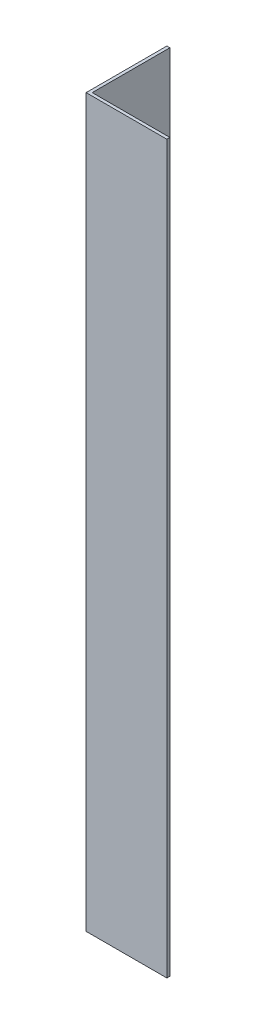
ISO-10303-21;
HEADER;
FILE_DESCRIPTION(('STEP AP214'),'2;1');
FILE_NAME('part.step','',(''),(''),'','','');
FILE_SCHEMA(('AUTOMOTIVE_DESIGN { 1 0 10303 214 1 1 1 1 }'));
ENDSEC;
DATA;
#1=APPLICATION_CONTEXT('core data for automotive mechanical design processes');
#2=APPLICATION_PROTOCOL_DEFINITION('international standard','automotive_design',2000,#1);
#3=PRODUCT_CONTEXT('',#1,'mechanical');
#4=PRODUCT('Part','Part','',(#3));
#5=PRODUCT_RELATED_PRODUCT_CATEGORY('part','',(#4));
#6=PRODUCT_DEFINITION_FORMATION('','',#4);
#7=PRODUCT_DEFINITION_CONTEXT('part definition',#1,'design');
#8=PRODUCT_DEFINITION('design','',#6,#7);
#9=PRODUCT_DEFINITION_SHAPE('','',#8);
#10=(LENGTH_UNIT() NAMED_UNIT(*) SI_UNIT(.MILLI.,.METRE.));
#11=(NAMED_UNIT(*) PLANE_ANGLE_UNIT() SI_UNIT($,.RADIAN.));
#12=(NAMED_UNIT(*) SI_UNIT($,.STERADIAN.) SOLID_ANGLE_UNIT());
#13=UNCERTAINTY_MEASURE_WITH_UNIT(LENGTH_MEASURE(1.E-05),#10,'distance_accuracy_value','');
#14=(GEOMETRIC_REPRESENTATION_CONTEXT(3) GLOBAL_UNCERTAINTY_ASSIGNED_CONTEXT((#13)) GLOBAL_UNIT_ASSIGNED_CONTEXT((#10,
#11,#12)) REPRESENTATION_CONTEXT('',''));
#15=CARTESIAN_POINT('',(0.,0.,0.));
#16=DIRECTION('',(0.,0.,1.));
#17=DIRECTION('',(1.,0.,0.));
#18=AXIS2_PLACEMENT_3D('',#15,#16,#17);
#19=CARTESIAN_POINT('',(20.,180.,0.));
#20=DIRECTION('',(0.,0.,-1.));
#21=DIRECTION('',(-1.,0.,0.));
#22=AXIS2_PLACEMENT_3D('',#19,#20,#21);
#23=PLANE('',#22);
#24=DIRECTION('',(1.,0.,0.));
#25=VECTOR('',#24,1.);
#26=CARTESIAN_POINT('',(20.,0.,0.));
#27=LINE('',#26,#25);
#28=CARTESIAN_POINT('',(0.,0.,0.));
#29=VERTEX_POINT('',#28);
#30=CARTESIAN_POINT('',(20.,0.,0.));
#31=VERTEX_POINT('',#30);
#32=EDGE_CURVE('E120',#29,#31,#27,.T.);
#33=ORIENTED_EDGE('',*,*,#32,.T.);
#34=DIRECTION('',(0.,-1.,0.));
#35=VECTOR('',#34,1.);
#36=CARTESIAN_POINT('',(20.,180.,0.));
#37=LINE('',#36,#35);
#38=CARTESIAN_POINT('',(20.,180.,0.));
#39=VERTEX_POINT('',#38);
#40=EDGE_CURVE('E11',#39,#31,#37,.T.);
#41=ORIENTED_EDGE('',*,*,#40,.F.);
#42=DIRECTION('',(1.,0.,0.));
#43=VECTOR('',#42,1.);
#44=CARTESIAN_POINT('',(20.,180.,0.));
#45=LINE('',#44,#43);
#46=CARTESIAN_POINT('',(0.,180.,0.));
#47=VERTEX_POINT('',#46);
#48=EDGE_CURVE('E130',#47,#39,#45,.T.);
#49=ORIENTED_EDGE('',*,*,#48,.F.);
#50=DIRECTION('',(0.,-1.,0.));
#51=VECTOR('',#50,1.);
#52=CARTESIAN_POINT('',(0.,180.,0.));
#53=LINE('',#52,#51);
#54=EDGE_CURVE('E116',#47,#29,#53,.T.);
#55=ORIENTED_EDGE('',*,*,#54,.T.);
#56=EDGE_LOOP('',(#33,#41,#49,#55));
#57=FACE_BOUND('',#56,.T.);
#58=ADVANCED_FACE('F36',(#57),#23,.F.);
#59=CARTESIAN_POINT('',(20.,180.,-0.75));
#60=DIRECTION('',(-1.,0.,0.));
#61=DIRECTION('',(0.,0.,1.));
#62=AXIS2_PLACEMENT_3D('',#59,#60,#61);
#63=PLANE('',#62);
#64=DIRECTION('',(0.,0.,-1.));
#65=VECTOR('',#64,1.);
#66=CARTESIAN_POINT('',(20.,0.,-0.75));
#67=LINE('',#66,#65);
#68=CARTESIAN_POINT('',(20.,0.,-0.75));
#69=VERTEX_POINT('',#68);
#70=EDGE_CURVE('E123',#31,#69,#67,.T.);
#71=ORIENTED_EDGE('',*,*,#70,.T.);
#72=DIRECTION('',(0.,-1.,0.));
#73=VECTOR('',#72,1.);
#74=CARTESIAN_POINT('',(20.,180.,-0.75));
#75=LINE('',#74,#73);
#76=CARTESIAN_POINT('',(20.,180.,-0.75));
#77=VERTEX_POINT('',#76);
#78=EDGE_CURVE('E44',#77,#69,#75,.T.);
#79=ORIENTED_EDGE('',*,*,#78,.F.);
#80=DIRECTION('',(0.,0.,-1.));
#81=VECTOR('',#80,1.);
#82=CARTESIAN_POINT('',(20.,180.,-0.75));
#83=LINE('',#82,#81);
#84=EDGE_CURVE('E89',#39,#77,#83,.T.);
#85=ORIENTED_EDGE('',*,*,#84,.F.);
#86=ORIENTED_EDGE('',*,*,#40,.T.);
#87=EDGE_LOOP('',(#71,#79,#85,#86));
#88=FACE_BOUND('',#87,.T.);
#89=ADVANCED_FACE('F154',(#88),#63,.F.);
#90=CARTESIAN_POINT('',(0.749999999999998,180.,-0.749999999999998));
#91=DIRECTION('',(0.,0.,1.));
#92=DIRECTION('',(1.,0.,0.));
#93=AXIS2_PLACEMENT_3D('',#90,#91,#92);
#94=PLANE('',#93);
#95=DIRECTION('',(-1.,0.,0.));
#96=VECTOR('',#95,1.);
#97=CARTESIAN_POINT('',(0.749999999999998,0.,-0.749999999999998));
#98=LINE('',#97,#96);
#99=CARTESIAN_POINT('',(0.749999999999998,0.,-0.749999999999998));
#100=VERTEX_POINT('',#99);
#101=EDGE_CURVE('E125',#69,#100,#98,.T.);
#102=ORIENTED_EDGE('',*,*,#101,.T.);
#103=DIRECTION('',(0.,-1.,0.));
#104=VECTOR('',#103,1.);
#105=CARTESIAN_POINT('',(0.749999999999998,180.,-0.749999999999998));
#106=LINE('',#105,#104);
#107=CARTESIAN_POINT('',(0.749999999999998,180.,-0.749999999999998));
#108=VERTEX_POINT('',#107);
#109=EDGE_CURVE('E111',#108,#100,#106,.T.);
#110=ORIENTED_EDGE('',*,*,#109,.F.);
#111=DIRECTION('',(-1.,0.,0.));
#112=VECTOR('',#111,1.);
#113=CARTESIAN_POINT('',(0.749999999999998,180.,-0.749999999999998));
#114=LINE('',#113,#112);
#115=EDGE_CURVE('E102',#77,#108,#114,.T.);
#116=ORIENTED_EDGE('',*,*,#115,.F.);
#117=ORIENTED_EDGE('',*,*,#78,.T.);
#118=EDGE_LOOP('',(#102,#110,#116,#117));
#119=FACE_BOUND('',#118,.T.);
#120=ADVANCED_FACE('F136',(#119),#94,.F.);
#121=CARTESIAN_POINT('',(0.749999999999998,180.,-20.));
#122=DIRECTION('',(-1.,0.,0.));
#123=DIRECTION('',(0.,0.,1.));
#124=AXIS2_PLACEMENT_3D('',#121,#122,#123);
#125=PLANE('',#124);
#126=DIRECTION('',(0.,0.,-1.));
#127=VECTOR('',#126,1.);
#128=CARTESIAN_POINT('',(0.749999999999998,0.,-20.));
#129=LINE('',#128,#127);
#130=CARTESIAN_POINT('',(0.749999999999998,0.,-20.));
#131=VERTEX_POINT('',#130);
#132=EDGE_CURVE('E110',#100,#131,#129,.T.);
#133=ORIENTED_EDGE('',*,*,#132,.T.);
#134=DIRECTION('',(0.,-1.,0.));
#135=VECTOR('',#134,1.);
#136=CARTESIAN_POINT('',(0.749999999999998,180.,-20.));
#137=LINE('',#136,#135);
#138=CARTESIAN_POINT('',(0.749999999999998,180.,-20.));
#139=VERTEX_POINT('',#138);
#140=EDGE_CURVE('E107',#139,#131,#137,.T.);
#141=ORIENTED_EDGE('',*,*,#140,.F.);
#142=DIRECTION('',(0.,0.,-1.));
#143=VECTOR('',#142,1.);
#144=CARTESIAN_POINT('',(0.749999999999998,180.,-20.));
#145=LINE('',#144,#143);
#146=EDGE_CURVE('E96',#108,#139,#145,.T.);
#147=ORIENTED_EDGE('',*,*,#146,.F.);
#148=ORIENTED_EDGE('',*,*,#109,.T.);
#149=EDGE_LOOP('',(#133,#141,#147,#148));
#150=FACE_BOUND('',#149,.T.);
#151=ADVANCED_FACE('F108',(#150),#125,.F.);
#152=CARTESIAN_POINT('',(0.,180.,-20.));
#153=DIRECTION('',(0.,0.,1.));
#154=DIRECTION('',(1.,0.,0.));
#155=AXIS2_PLACEMENT_3D('',#152,#153,#154);
#156=PLANE('',#155);
#157=DIRECTION('',(-1.,0.,0.));
#158=VECTOR('',#157,1.);
#159=CARTESIAN_POINT('',(0.,0.,-20.));
#160=LINE('',#159,#158);
#161=CARTESIAN_POINT('',(0.,0.,-20.));
#162=VERTEX_POINT('',#161);
#163=EDGE_CURVE('E75',#131,#162,#160,.T.);
#164=ORIENTED_EDGE('',*,*,#163,.T.);
#165=DIRECTION('',(0.,-1.,0.));
#166=VECTOR('',#165,1.);
#167=CARTESIAN_POINT('',(0.,180.,-20.));
#168=LINE('',#167,#166);
#169=CARTESIAN_POINT('',(0.,180.,-20.));
#170=VERTEX_POINT('',#169);
#171=EDGE_CURVE('E112',#170,#162,#168,.T.);
#172=ORIENTED_EDGE('',*,*,#171,.F.);
#173=DIRECTION('',(-1.,0.,0.));
#174=VECTOR('',#173,1.);
#175=CARTESIAN_POINT('',(0.,180.,-20.));
#176=LINE('',#175,#174);
#177=EDGE_CURVE('E100',#139,#170,#176,.T.);
#178=ORIENTED_EDGE('',*,*,#177,.F.);
#179=ORIENTED_EDGE('',*,*,#140,.T.);
#180=EDGE_LOOP('',(#164,#172,#178,#179));
#181=FACE_BOUND('',#180,.T.);
#182=ADVANCED_FACE('F114',(#181),#156,.F.);
#183=CARTESIAN_POINT('',(0.,180.,0.));
#184=DIRECTION('',(1.,0.,0.));
#185=DIRECTION('',(0.,0.,-1.));
#186=AXIS2_PLACEMENT_3D('',#183,#184,#185);
#187=PLANE('',#186);
#188=DIRECTION('',(0.,0.,1.));
#189=VECTOR('',#188,1.);
#190=CARTESIAN_POINT('',(0.,0.,0.));
#191=LINE('',#190,#189);
#192=EDGE_CURVE('E81',#162,#29,#191,.T.);
#193=ORIENTED_EDGE('',*,*,#192,.T.);
#194=ORIENTED_EDGE('',*,*,#54,.F.);
#195=DIRECTION('',(0.,0.,1.));
#196=VECTOR('',#195,1.);
#197=CARTESIAN_POINT('',(0.,180.,0.));
#198=LINE('',#197,#196);
#199=EDGE_CURVE('E52',#170,#47,#198,.T.);
#200=ORIENTED_EDGE('',*,*,#199,.F.);
#201=ORIENTED_EDGE('',*,*,#171,.T.);
#202=EDGE_LOOP('',(#193,#194,#200,#201));
#203=FACE_BOUND('',#202,.T.);
#204=ADVANCED_FACE('F143',(#203),#187,.F.);
#205=CARTESIAN_POINT('',(0.,180.,0.));
#206=DIRECTION('',(0.,-1.,0.));
#207=DIRECTION('',(0.,0.,-1.));
#208=AXIS2_PLACEMENT_3D('',#205,#206,#207);
#209=PLANE('',#208);
#210=ORIENTED_EDGE('',*,*,#48,.T.);
#211=ORIENTED_EDGE('',*,*,#84,.T.);
#212=ORIENTED_EDGE('',*,*,#115,.T.);
#213=ORIENTED_EDGE('',*,*,#146,.T.);
#214=ORIENTED_EDGE('',*,*,#177,.T.);
#215=ORIENTED_EDGE('',*,*,#199,.T.);
#216=EDGE_LOOP('',(#210,#211,#212,#213,#214,#215));
#217=FACE_BOUND('',#216,.T.);
#218=ADVANCED_FACE('F98',(#217),#209,.F.);
#219=CARTESIAN_POINT('',(0.,0.,0.));
#220=DIRECTION('',(0.,-1.,0.));
#221=DIRECTION('',(0.,0.,-1.));
#222=AXIS2_PLACEMENT_3D('',#219,#220,#221);
#223=PLANE('',#222);
#224=ORIENTED_EDGE('',*,*,#32,.F.);
#225=ORIENTED_EDGE('',*,*,#192,.F.);
#226=ORIENTED_EDGE('',*,*,#163,.F.);
#227=ORIENTED_EDGE('',*,*,#132,.F.);
#228=ORIENTED_EDGE('',*,*,#101,.F.);
#229=ORIENTED_EDGE('',*,*,#70,.F.);
#230=EDGE_LOOP('',(#224,#225,#226,#227,#228,#229));
#231=FACE_BOUND('',#230,.T.);
#232=ADVANCED_FACE('F139',(#231),#223,.T.);
#233=CLOSED_SHELL('',(#58,#89,#120,#151,#182,#204,#218,#232));
#234=MANIFOLD_SOLID_BREP('B2',#233);
#235=ADVANCED_BREP_SHAPE_REPRESENTATION('',(#18,#234),#14);
#236=SHAPE_DEFINITION_REPRESENTATION(#9,#235);
ENDSEC;
END-ISO-10303-21;
